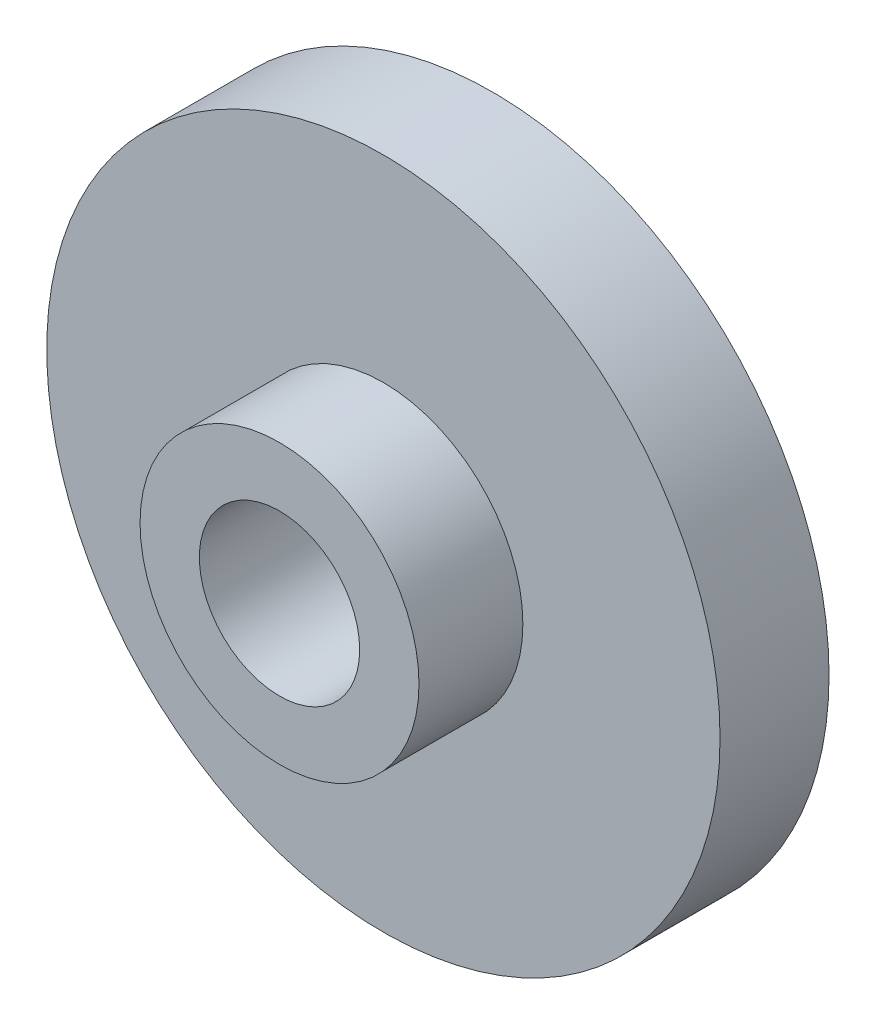
ISO-10303-21;
HEADER;
FILE_DESCRIPTION(('STEP AP214'),'2;1');
FILE_NAME('part.step','',(''),(''),'','','');
FILE_SCHEMA(('AUTOMOTIVE_DESIGN { 1 0 10303 214 1 1 1 1 }'));
ENDSEC;
DATA;
#1=APPLICATION_CONTEXT('core data for automotive mechanical design processes');
#2=APPLICATION_PROTOCOL_DEFINITION('international standard','automotive_design',2000,#1);
#3=PRODUCT_CONTEXT('',#1,'mechanical');
#4=PRODUCT('Part','Part','',(#3));
#5=PRODUCT_RELATED_PRODUCT_CATEGORY('part','',(#4));
#6=PRODUCT_DEFINITION_FORMATION('','',#4);
#7=PRODUCT_DEFINITION_CONTEXT('part definition',#1,'design');
#8=PRODUCT_DEFINITION('design','',#6,#7);
#9=PRODUCT_DEFINITION_SHAPE('','',#8);
#10=(LENGTH_UNIT() NAMED_UNIT(*) SI_UNIT(.MILLI.,.METRE.));
#11=(NAMED_UNIT(*) PLANE_ANGLE_UNIT() SI_UNIT($,.RADIAN.));
#12=(NAMED_UNIT(*) SI_UNIT($,.STERADIAN.) SOLID_ANGLE_UNIT());
#13=UNCERTAINTY_MEASURE_WITH_UNIT(LENGTH_MEASURE(1.E-05),#10,'distance_accuracy_value','');
#14=(GEOMETRIC_REPRESENTATION_CONTEXT(3) GLOBAL_UNCERTAINTY_ASSIGNED_CONTEXT((#13)) GLOBAL_UNIT_ASSIGNED_CONTEXT((#10,
#11,#12)) REPRESENTATION_CONTEXT('',''));
#15=CARTESIAN_POINT('',(0.,0.,0.));
#16=DIRECTION('',(0.,0.,1.));
#17=DIRECTION('',(1.,0.,0.));
#18=AXIS2_PLACEMENT_3D('',#15,#16,#17);
#19=CARTESIAN_POINT('',(0.,0.,3.4));
#20=DIRECTION('',(0.,0.,-1.));
#21=DIRECTION('',(-1.,0.,0.));
#22=AXIS2_PLACEMENT_3D('',#19,#20,#21);
#23=CYLINDRICAL_SURFACE('',#22,10.5);
#24=CARTESIAN_POINT('',(0.,0.,3.4));
#25=DIRECTION('',(0.,0.,1.));
#26=DIRECTION('',(1.,0.,0.));
#27=AXIS2_PLACEMENT_3D('',#24,#25,#26);
#28=CIRCLE('',#27,10.5);
#29=CARTESIAN_POINT('',(10.5,0.,3.4));
#30=VERTEX_POINT('',#29);
#31=EDGE_CURVE('E45',#30,#30,#28,.T.);
#32=ORIENTED_EDGE('',*,*,#31,.F.);
#33=EDGE_LOOP('',(#32));
#34=FACE_BOUND('',#33,.T.);
#35=CARTESIAN_POINT('',(0.,0.,0.));
#36=DIRECTION('',(0.,0.,1.));
#37=DIRECTION('',(1.,0.,0.));
#38=AXIS2_PLACEMENT_3D('',#35,#36,#37);
#39=CIRCLE('',#38,10.5);
#40=CARTESIAN_POINT('',(10.5,0.,0.));
#41=VERTEX_POINT('',#40);
#42=EDGE_CURVE('E40',#41,#41,#39,.T.);
#43=ORIENTED_EDGE('',*,*,#42,.T.);
#44=EDGE_LOOP('',(#43));
#45=FACE_BOUND('',#44,.T.);
#46=ADVANCED_FACE('F37',(#34,#45),#23,.T.);
#47=CARTESIAN_POINT('',(0.,0.,3.4));
#48=DIRECTION('',(0.,0.,1.));
#49=DIRECTION('',(1.,0.,0.));
#50=AXIS2_PLACEMENT_3D('',#47,#48,#49);
#51=PLANE('',#50);
#52=CARTESIAN_POINT('',(0.,0.,3.4));
#53=DIRECTION('',(0.,0.,1.));
#54=DIRECTION('',(1.,0.,0.));
#55=AXIS2_PLACEMENT_3D('',#52,#53,#54);
#56=CIRCLE('',#55,4.35);
#57=CARTESIAN_POINT('',(4.35,0.,3.4));
#58=VERTEX_POINT('',#57);
#59=EDGE_CURVE('E10',#58,#58,#56,.T.);
#60=ORIENTED_EDGE('',*,*,#59,.F.);
#61=EDGE_LOOP('',(#60));
#62=FACE_BOUND('',#61,.T.);
#63=ORIENTED_EDGE('',*,*,#31,.T.);
#64=EDGE_LOOP('',(#63));
#65=FACE_BOUND('',#64,.T.);
#66=ADVANCED_FACE('F81',(#62,#65),#51,.T.);
#67=CARTESIAN_POINT('',(0.,0.,0.));
#68=DIRECTION('',(0.,0.,1.));
#69=DIRECTION('',(1.,0.,0.));
#70=AXIS2_PLACEMENT_3D('',#67,#68,#69);
#71=PLANE('',#70);
#72=CARTESIAN_POINT('',(0.,0.,0.));
#73=DIRECTION('',(0.,0.,1.));
#74=DIRECTION('',(1.,0.,0.));
#75=AXIS2_PLACEMENT_3D('',#72,#73,#74);
#76=CIRCLE('',#75,2.5);
#77=CARTESIAN_POINT('',(2.5,0.,0.));
#78=VERTEX_POINT('',#77);
#79=EDGE_CURVE('E56',#78,#78,#76,.T.);
#80=ORIENTED_EDGE('',*,*,#79,.T.);
#81=EDGE_LOOP('',(#80));
#82=FACE_BOUND('',#81,.T.);
#83=ORIENTED_EDGE('',*,*,#42,.F.);
#84=EDGE_LOOP('',(#83));
#85=FACE_BOUND('',#84,.T.);
#86=ADVANCED_FACE('F76',(#82,#85),#71,.F.);
#87=CARTESIAN_POINT('',(0.,0.,6.64));
#88=DIRECTION('',(0.,0.,-1.));
#89=DIRECTION('',(-1.,0.,0.));
#90=AXIS2_PLACEMENT_3D('',#87,#88,#89);
#91=CYLINDRICAL_SURFACE('',#90,4.35);
#92=CARTESIAN_POINT('',(0.,0.,6.64));
#93=DIRECTION('',(0.,0.,1.));
#94=DIRECTION('',(1.,0.,0.));
#95=AXIS2_PLACEMENT_3D('',#92,#93,#94);
#96=CIRCLE('',#95,4.35);
#97=CARTESIAN_POINT('',(4.35,0.,6.64));
#98=VERTEX_POINT('',#97);
#99=EDGE_CURVE('E52',#98,#98,#96,.T.);
#100=ORIENTED_EDGE('',*,*,#99,.F.);
#101=EDGE_LOOP('',(#100));
#102=FACE_BOUND('',#101,.T.);
#103=ORIENTED_EDGE('',*,*,#59,.T.);
#104=EDGE_LOOP('',(#103));
#105=FACE_BOUND('',#104,.T.);
#106=ADVANCED_FACE('F71',(#102,#105),#91,.T.);
#107=CARTESIAN_POINT('',(0.,0.,6.64));
#108=DIRECTION('',(0.,0.,1.));
#109=DIRECTION('',(1.,0.,0.));
#110=AXIS2_PLACEMENT_3D('',#107,#108,#109);
#111=PLANE('',#110);
#112=CARTESIAN_POINT('',(0.,0.,6.64));
#113=DIRECTION('',(0.,0.,1.));
#114=DIRECTION('',(1.,0.,0.));
#115=AXIS2_PLACEMENT_3D('',#112,#113,#114);
#116=CIRCLE('',#115,2.5);
#117=CARTESIAN_POINT('',(2.5,0.,6.64));
#118=VERTEX_POINT('',#117);
#119=EDGE_CURVE('E60',#118,#118,#116,.T.);
#120=ORIENTED_EDGE('',*,*,#119,.F.);
#121=EDGE_LOOP('',(#120));
#122=FACE_BOUND('',#121,.T.);
#123=ORIENTED_EDGE('',*,*,#99,.T.);
#124=EDGE_LOOP('',(#123));
#125=FACE_BOUND('',#124,.T.);
#126=ADVANCED_FACE('F68',(#122,#125),#111,.T.);
#127=CARTESIAN_POINT('',(0.,0.,-9.6));
#128=DIRECTION('',(0.,0.,1.));
#129=DIRECTION('',(1.,0.,0.));
#130=AXIS2_PLACEMENT_3D('',#127,#128,#129);
#131=CYLINDRICAL_SURFACE('',#130,2.5);
#132=ORIENTED_EDGE('',*,*,#119,.T.);
#133=EDGE_LOOP('',(#132));
#134=FACE_BOUND('',#133,.T.);
#135=ORIENTED_EDGE('',*,*,#79,.F.);
#136=EDGE_LOOP('',(#135));
#137=FACE_BOUND('',#136,.T.);
#138=ADVANCED_FACE('F65',(#134,#137),#131,.F.);
#139=CLOSED_SHELL('',(#46,#66,#86,#106,#126,#138));
#140=MANIFOLD_SOLID_BREP('B2',#139);
#141=ADVANCED_BREP_SHAPE_REPRESENTATION('',(#18,#140),#14);
#142=SHAPE_DEFINITION_REPRESENTATION(#9,#141);
ENDSEC;
END-ISO-10303-21;
